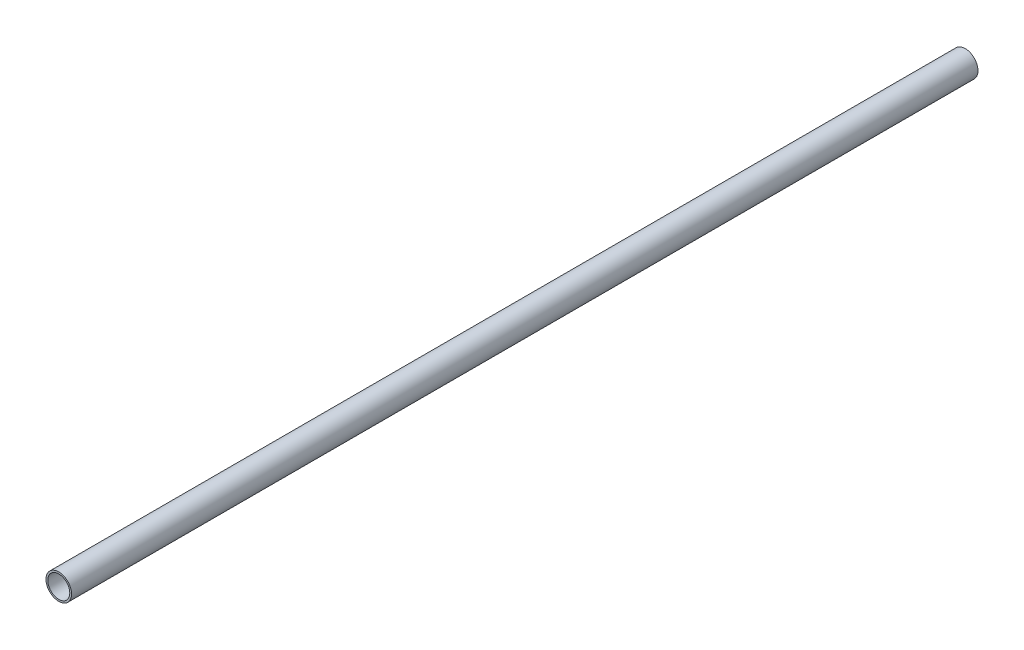
ISO-10303-21;
HEADER;
FILE_DESCRIPTION(('STEP AP214'),'2;1');
FILE_NAME('part.step','',(''),(''),'','','');
FILE_SCHEMA(('AUTOMOTIVE_DESIGN { 1 0 10303 214 1 1 1 1 }'));
ENDSEC;
DATA;
#1=APPLICATION_CONTEXT('core data for automotive mechanical design processes');
#2=APPLICATION_PROTOCOL_DEFINITION('international standard','automotive_design',2000,#1);
#3=PRODUCT_CONTEXT('',#1,'mechanical');
#4=PRODUCT('Part','Part','',(#3));
#5=PRODUCT_RELATED_PRODUCT_CATEGORY('part','',(#4));
#6=PRODUCT_DEFINITION_FORMATION('','',#4);
#7=PRODUCT_DEFINITION_CONTEXT('part definition',#1,'design');
#8=PRODUCT_DEFINITION('design','',#6,#7);
#9=PRODUCT_DEFINITION_SHAPE('','',#8);
#10=(LENGTH_UNIT() NAMED_UNIT(*) SI_UNIT(.MILLI.,.METRE.));
#11=(NAMED_UNIT(*) PLANE_ANGLE_UNIT() SI_UNIT($,.RADIAN.));
#12=(NAMED_UNIT(*) SI_UNIT($,.STERADIAN.) SOLID_ANGLE_UNIT());
#13=UNCERTAINTY_MEASURE_WITH_UNIT(LENGTH_MEASURE(1.E-05),#10,'distance_accuracy_value','');
#14=(GEOMETRIC_REPRESENTATION_CONTEXT(3) GLOBAL_UNCERTAINTY_ASSIGNED_CONTEXT((#13)) GLOBAL_UNIT_ASSIGNED_CONTEXT((#10,
#11,#12)) REPRESENTATION_CONTEXT('',''));
#15=CARTESIAN_POINT('',(0.,0.,0.));
#16=DIRECTION('',(0.,0.,1.));
#17=DIRECTION('',(1.,0.,0.));
#18=AXIS2_PLACEMENT_3D('',#15,#16,#17);
#19=CARTESIAN_POINT('',(0.,0.,450.));
#20=DIRECTION('',(0.,0.,1.));
#21=DIRECTION('',(1.,0.,0.));
#22=AXIS2_PLACEMENT_3D('',#19,#20,#21);
#23=PLANE('',#22);
#24=CARTESIAN_POINT('',(0.,0.,450.));
#25=DIRECTION('',(0.,0.,1.));
#26=DIRECTION('',(1.,0.,0.));
#27=AXIS2_PLACEMENT_3D('',#24,#25,#26);
#28=CIRCLE('',#27,6.35);
#29=CARTESIAN_POINT('',(6.35,0.,450.));
#30=VERTEX_POINT('',#29);
#31=EDGE_CURVE('E10',#30,#30,#28,.T.);
#32=ORIENTED_EDGE('',*,*,#31,.T.);
#33=EDGE_LOOP('',(#32));
#34=FACE_BOUND('',#33,.T.);
#35=CARTESIAN_POINT('',(0.,0.,450.));
#36=DIRECTION('',(0.,0.,1.));
#37=DIRECTION('',(1.,0.,0.));
#38=AXIS2_PLACEMENT_3D('',#35,#36,#37);
#39=CIRCLE('',#38,5.461);
#40=CARTESIAN_POINT('',(5.461,0.,450.));
#41=VERTEX_POINT('',#40);
#42=EDGE_CURVE('E50',#41,#41,#39,.T.);
#43=ORIENTED_EDGE('',*,*,#42,.F.);
#44=EDGE_LOOP('',(#43));
#45=FACE_BOUND('',#44,.T.);
#46=ADVANCED_FACE('F37',(#34,#45),#23,.T.);
#47=CARTESIAN_POINT('',(0.,0.,0.));
#48=DIRECTION('',(0.,0.,1.));
#49=DIRECTION('',(1.,0.,0.));
#50=AXIS2_PLACEMENT_3D('',#47,#48,#49);
#51=PLANE('',#50);
#52=CARTESIAN_POINT('',(0.,0.,0.));
#53=DIRECTION('',(0.,0.,1.));
#54=DIRECTION('',(1.,0.,0.));
#55=AXIS2_PLACEMENT_3D('',#52,#53,#54);
#56=CIRCLE('',#55,6.35);
#57=CARTESIAN_POINT('',(6.35,0.,0.));
#58=VERTEX_POINT('',#57);
#59=EDGE_CURVE('E41',#58,#58,#56,.T.);
#60=ORIENTED_EDGE('',*,*,#59,.F.);
#61=EDGE_LOOP('',(#60));
#62=FACE_BOUND('',#61,.T.);
#63=CARTESIAN_POINT('',(0.,0.,0.));
#64=DIRECTION('',(0.,0.,1.));
#65=DIRECTION('',(1.,0.,0.));
#66=AXIS2_PLACEMENT_3D('',#63,#64,#65);
#67=CIRCLE('',#66,5.461);
#68=CARTESIAN_POINT('',(5.461,0.,0.));
#69=VERTEX_POINT('',#68);
#70=EDGE_CURVE('E52',#69,#69,#67,.T.);
#71=ORIENTED_EDGE('',*,*,#70,.T.);
#72=EDGE_LOOP('',(#71));
#73=FACE_BOUND('',#72,.T.);
#74=ADVANCED_FACE('F64',(#62,#73),#51,.F.);
#75=CARTESIAN_POINT('',(0.,0.,450.));
#76=DIRECTION('',(0.,0.,-1.));
#77=DIRECTION('',(-1.,0.,0.));
#78=AXIS2_PLACEMENT_3D('',#75,#76,#77);
#79=CYLINDRICAL_SURFACE('',#78,6.35);
#80=ORIENTED_EDGE('',*,*,#31,.F.);
#81=EDGE_LOOP('',(#80));
#82=FACE_BOUND('',#81,.T.);
#83=ORIENTED_EDGE('',*,*,#59,.T.);
#84=EDGE_LOOP('',(#83));
#85=FACE_BOUND('',#84,.T.);
#86=ADVANCED_FACE('F39',(#82,#85),#79,.T.);
#87=CARTESIAN_POINT('',(0.,0.,450.));
#88=DIRECTION('',(0.,0.,-1.));
#89=DIRECTION('',(-1.,0.,0.));
#90=AXIS2_PLACEMENT_3D('',#87,#88,#89);
#91=CYLINDRICAL_SURFACE('',#90,5.461);
#92=ORIENTED_EDGE('',*,*,#42,.T.);
#93=EDGE_LOOP('',(#92));
#94=FACE_BOUND('',#93,.T.);
#95=ORIENTED_EDGE('',*,*,#70,.F.);
#96=EDGE_LOOP('',(#95));
#97=FACE_BOUND('',#96,.T.);
#98=ADVANCED_FACE('F60',(#94,#97),#91,.F.);
#99=CLOSED_SHELL('',(#46,#74,#86,#98));
#100=MANIFOLD_SOLID_BREP('B2',#99);
#101=ADVANCED_BREP_SHAPE_REPRESENTATION('',(#18,#100),#14);
#102=SHAPE_DEFINITION_REPRESENTATION(#9,#101);
ENDSEC;
END-ISO-10303-21;
